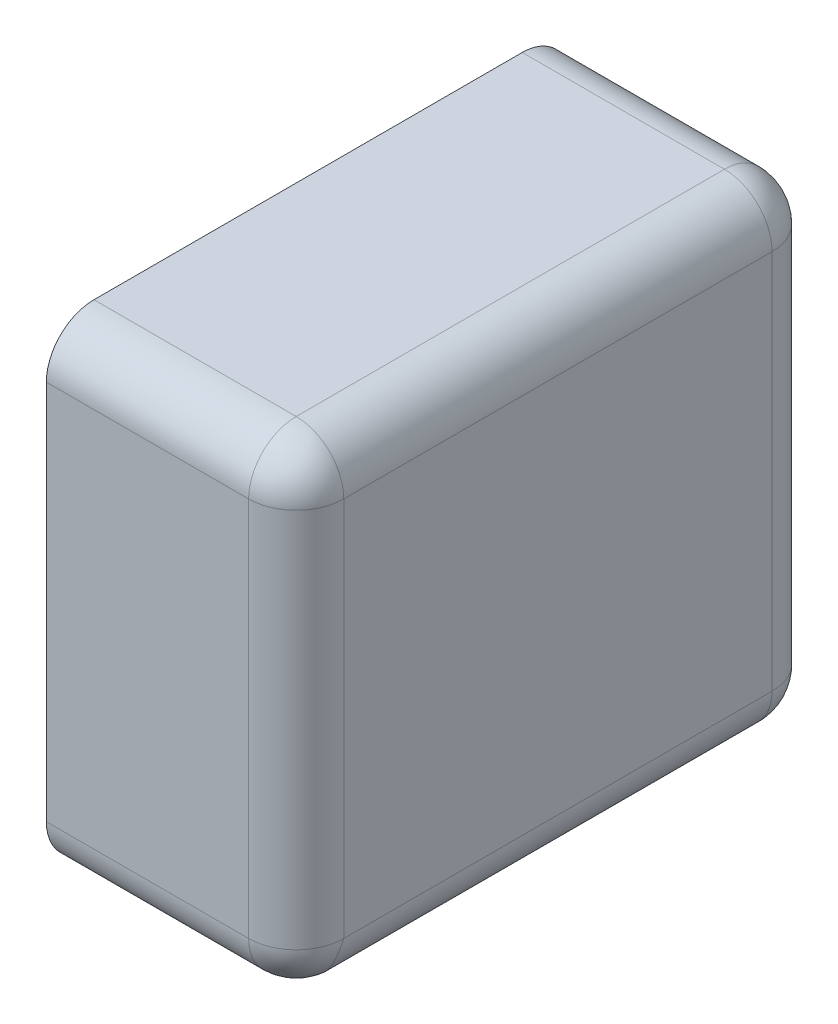
ISO-10303-21;
HEADER;
FILE_DESCRIPTION(('STEP AP214'),'2;1');
FILE_NAME('part.step','',(''),(''),'','','');
FILE_SCHEMA(('AUTOMOTIVE_DESIGN { 1 0 10303 214 1 1 1 1 }'));
ENDSEC;
DATA;
#1=APPLICATION_CONTEXT('core data for automotive mechanical design processes');
#2=APPLICATION_PROTOCOL_DEFINITION('international standard','automotive_design',2000,#1);
#3=PRODUCT_CONTEXT('',#1,'mechanical');
#4=PRODUCT('Part','Part','',(#3));
#5=PRODUCT_RELATED_PRODUCT_CATEGORY('part','',(#4));
#6=PRODUCT_DEFINITION_FORMATION('','',#4);
#7=PRODUCT_DEFINITION_CONTEXT('part definition',#1,'design');
#8=PRODUCT_DEFINITION('design','',#6,#7);
#9=PRODUCT_DEFINITION_SHAPE('','',#8);
#10=(LENGTH_UNIT() NAMED_UNIT(*) SI_UNIT(.MILLI.,.METRE.));
#11=(NAMED_UNIT(*) PLANE_ANGLE_UNIT() SI_UNIT($,.RADIAN.));
#12=(NAMED_UNIT(*) SI_UNIT($,.STERADIAN.) SOLID_ANGLE_UNIT());
#13=UNCERTAINTY_MEASURE_WITH_UNIT(LENGTH_MEASURE(1.E-05),#10,'distance_accuracy_value','');
#14=(GEOMETRIC_REPRESENTATION_CONTEXT(3) GLOBAL_UNCERTAINTY_ASSIGNED_CONTEXT((#13)) GLOBAL_UNIT_ASSIGNED_CONTEXT((#10,
#11,#12)) REPRESENTATION_CONTEXT('',''));
#15=CARTESIAN_POINT('',(0.,0.,0.));
#16=DIRECTION('',(0.,0.,1.));
#17=DIRECTION('',(1.,0.,0.));
#18=AXIS2_PLACEMENT_3D('',#15,#16,#17);
#19=CARTESIAN_POINT('',(0.270000000000001,0.12,0.));
#20=DIRECTION('',(0.,0.,1.));
#21=DIRECTION('',(0.707106781186548,0.707106781186547,0.));
#22=AXIS2_PLACEMENT_3D('',#19,#20,#21);
#23=CYLINDRICAL_SURFACE('',#22,0.03);
#24=CARTESIAN_POINT('',(0.270000000000001,0.12,0.03));
#25=DIRECTION('',(0.,0.,-1.));
#26=DIRECTION('',(0.707106781186548,0.707106781186547,0.));
#27=AXIS2_PLACEMENT_3D('',#24,#25,#26);
#28=CIRCLE('',#27,0.03);
#29=CARTESIAN_POINT('',(0.270000000000001,0.15,0.03));
#30=VERTEX_POINT('',#29);
#31=CARTESIAN_POINT('',(0.3,0.12,0.03));
#32=VERTEX_POINT('',#31);
#33=EDGE_CURVE('E11',#30,#32,#28,.T.);
#34=ORIENTED_EDGE('',*,*,#33,.F.);
#35=DIRECTION('',(0.,0.,1.));
#36=VECTOR('',#35,1.);
#37=CARTESIAN_POINT('',(0.270000000000001,0.15,0.));
#38=LINE('',#37,#36);
#39=CARTESIAN_POINT('',(0.270000000000001,0.15,0.3));
#40=VERTEX_POINT('',#39);
#41=EDGE_CURVE('E24',#30,#40,#38,.T.);
#42=ORIENTED_EDGE('',*,*,#41,.T.);
#43=CARTESIAN_POINT('',(0.270000000000001,0.12,0.3));
#44=DIRECTION('',(0.,0.,1.));
#45=DIRECTION('',(0.707106781186548,0.707106781186547,0.));
#46=AXIS2_PLACEMENT_3D('',#43,#44,#45);
#47=CIRCLE('',#46,0.03);
#48=CARTESIAN_POINT('',(0.3,0.12,0.3));
#49=VERTEX_POINT('',#48);
#50=EDGE_CURVE('E446',#49,#40,#47,.T.);
#51=ORIENTED_EDGE('',*,*,#50,.F.);
#52=DIRECTION('',(0.,0.,-1.));
#53=VECTOR('',#52,1.);
#54=CARTESIAN_POINT('',(0.3,0.12,0.));
#55=LINE('',#54,#53);
#56=EDGE_CURVE('E444',#49,#32,#55,.T.);
#57=ORIENTED_EDGE('',*,*,#56,.T.);
#58=EDGE_LOOP('',(#34,#42,#51,#57));
#59=FACE_BOUND('',#58,.T.);
#60=ADVANCED_FACE('F17',(#59),#23,.T.);
#61=CARTESIAN_POINT('',(0.27,-0.12,0.3));
#62=DIRECTION('',(-0.816496580927727,-0.408248290463863,0.408248290463862));
#63=DIRECTION('',(0.577350269189625,-0.577350269189627,0.577350269189625));
#64=AXIS2_PLACEMENT_3D('',#61,#62,#63);
#65=SPHERICAL_SURFACE('',#64,0.03);
#66=CARTESIAN_POINT('',(0.27,-0.12,0.3));
#67=DIRECTION('',(-1.,0.,0.));
#68=DIRECTION('',(0.,-1.,0.));
#69=AXIS2_PLACEMENT_3D('',#66,#67,#68);
#70=CIRCLE('',#69,0.03);
#71=CARTESIAN_POINT('',(0.27,-0.15,0.3));
#72=VERTEX_POINT('',#71);
#73=CARTESIAN_POINT('',(0.27,-0.12,0.33));
#74=VERTEX_POINT('',#73);
#75=EDGE_CURVE('E443',#72,#74,#70,.T.);
#76=ORIENTED_EDGE('',*,*,#75,.F.);
#77=CARTESIAN_POINT('',(0.27,-0.15,0.3));
#78=CARTESIAN_POINT('',(0.2704988114566,-0.15000001218838,0.300033885984529));
#79=CARTESIAN_POINT('',(0.270997266674897,-0.149987502790529,0.300072700986934));
#80=CARTESIAN_POINT('',(0.271994414549251,-0.149937417339022,0.300159234717374));
#81=CARTESIAN_POINT('',(0.272493098142923,-0.149899728520835,0.300206992800863));
#82=CARTESIAN_POINT('',(0.273489141663646,-0.149799058547557,0.300310340802986));
#83=CARTESIAN_POINT('',(0.273986488076972,-0.149735975701534,0.300365961620001));
#84=CARTESIAN_POINT('',(0.274978329987218,-0.149584423439013,0.300483912490024));
#85=CARTESIAN_POINT('',(0.275472809014332,-0.149495864378045,0.30054626574015));
#86=CARTESIAN_POINT('',(0.276457408349491,-0.149293375435409,0.300676517251717));
#87=CARTESIAN_POINT('',(0.276947510656095,-0.14917936863514,0.300744431920565));
#88=CARTESIAN_POINT('',(0.277921879210046,-0.148926117168614,0.300884606505975));
#89=CARTESIAN_POINT('',(0.278406127362682,-0.148786808810621,0.300956877073712));
#90=CARTESIAN_POINT('',(0.279367344700468,-0.148483203157651,0.301104535317345));
#91=CARTESIAN_POINT('',(0.279844297105908,-0.148318855688421,0.301179929025555));
#92=CARTESIAN_POINT('',(0.280789520120333,-0.14796553704088,0.301332584129445));
#93=CARTESIAN_POINT('',(0.281257776631302,-0.147776529291588,0.301409848157373));
#94=CARTESIAN_POINT('',(0.282184250050681,-0.147374370790128,0.301564980486512));
#95=CARTESIAN_POINT('',(0.282642456850724,-0.147161196950527,0.301642849298233));
#96=CARTESIAN_POINT('',(0.28354752291707,-0.146711301214479,0.301797921149039));
#97=CARTESIAN_POINT('',(0.283994377299662,-0.146474569391927,0.301875123892462));
#98=CARTESIAN_POINT('',(0.284875485043225,-0.145978265027613,0.302027594347783));
#99=CARTESIAN_POINT('',(0.28530973989387,-0.145718695200802,0.302102862288317));
#100=CARTESIAN_POINT('',(0.286164453839678,-0.145177532158359,0.302250202096889));
#101=CARTESIAN_POINT('',(0.286584921848203,-0.144895953586706,0.302322276040923));
#102=CARTESIAN_POINT('',(0.287410930152302,-0.144311697423408,0.302461982438935));
#103=CARTESIAN_POINT('',(0.287816487725631,-0.144009045509088,0.302529620109706));
#104=CARTESIAN_POINT('',(0.288611609698811,-0.143383670573753,0.302659231507785));
#105=CARTESIAN_POINT('',(0.289001200561672,-0.143060983194026,0.302721214834487));
#106=CARTESIAN_POINT('',(0.289763393553022,-0.142396664765597,0.302838325292687));
#107=CARTESIAN_POINT('',(0.290136032021387,-0.142055078090956,0.302893467574624));
#108=CARTESIAN_POINT('',(0.290863397634121,-0.141354183506085,0.302995740989442));
#109=CARTESIAN_POINT('',(0.29121817154898,-0.140994927323628,0.303042893897565));
#110=CARTESIAN_POINT('',(0.291908961165091,-0.140260006134148,0.303128077826375));
#111=CARTESIAN_POINT('',(0.292245034475513,-0.139884398697804,0.303166138205415));
#112=CARTESIAN_POINT('',(0.292897654069066,-0.139118171903413,0.303232077255572));
#113=CARTESIAN_POINT('',(0.293214269055406,-0.138727614334856,0.303259993690955));
#114=CARTESIAN_POINT('',(0.293827283277693,-0.137932962741796,0.303304642403207));
#115=CARTESIAN_POINT('',(0.294123762407378,-0.137528933009151,0.30332142151845));
#116=CARTESIAN_POINT('',(0.294695897931203,-0.136708884767313,0.303342856676105));
#117=CARTESIAN_POINT('',(0.294971645342014,-0.136292931267141,0.303347569126694));
#118=CARTESIAN_POINT('',(0.295501793454286,-0.135450648652353,0.303344001427956));
#119=CARTESIAN_POINT('',(0.295756296059558,-0.135024383436286,0.303335787563462));
#120=CARTESIAN_POINT('',(0.296243514501363,-0.134163148910546,0.303305572586257));
#121=CARTESIAN_POINT('',(0.296476342722002,-0.133728240548299,0.303283647738719));
#122=CARTESIAN_POINT('',(0.29691985675561,-0.132851442274516,0.303225296173099));
#123=CARTESIAN_POINT('',(0.297130664853887,-0.132409608537143,0.303188955588915));
#124=CARTESIAN_POINT('',(0.297529867626478,-0.131520725008768,0.303101142559795));
#125=CARTESIAN_POINT('',(0.297718393736061,-0.131073724852721,0.30304976578243));
#126=CARTESIAN_POINT('',(0.298072845692959,-0.130176310223072,0.302931339667545));
#127=CARTESIAN_POINT('',(0.298238911206526,-0.129725937163117,0.302864394964426));
#128=CARTESIAN_POINT('',(0.298548339496165,-0.128823601756171,0.302714383979636));
#129=CARTESIAN_POINT('',(0.29869184908149,-0.128371671082917,0.302631430511459));
#130=CARTESIAN_POINT('',(0.298956143515048,-0.12746807783126,0.30244905323905));
#131=CARTESIAN_POINT('',(0.299077081092125,-0.127016435722467,0.3023497493774));
#132=CARTESIAN_POINT('',(0.29929629941659,-0.126115236256513,0.302134406235816));
#133=CARTESIAN_POINT('',(0.299394737369101,-0.125665687375364,0.302018492898807));
#134=CARTESIAN_POINT('',(0.299525735241222,-0.1249931673045,0.301831639421765));
#135=CARTESIAN_POINT('',(0.299566536092966,-0.124769899562591,0.301767383329066));
#136=CARTESIAN_POINT('',(0.29964255533454,-0.12432458245702,0.301634658700018));
#137=CARTESIAN_POINT('',(0.299677793860668,-0.124102531645172,0.301566206664674));
#138=CARTESIAN_POINT('',(0.299742716016461,-0.123659887617396,0.301425089688796));
#139=CARTESIAN_POINT('',(0.299772419851868,-0.123439292053119,0.301352441393567));
#140=CARTESIAN_POINT('',(0.299826307791658,-0.122999785093463,0.301202935202406));
#141=CARTESIAN_POINT('',(0.299850512107089,-0.12278087048501,0.301126094051073));
#142=CARTESIAN_POINT('',(0.299893439937734,-0.122344953783418,0.300968212611414));
#143=CARTESIAN_POINT('',(0.299912183618114,-0.122127947599275,0.300887189107669));
#144=CARTESIAN_POINT('',(0.29994423389955,-0.121696073785566,0.300720959873868));
#145=CARTESIAN_POINT('',(0.299957560563846,-0.121481201194103,0.300635770910294));
#146=CARTESIAN_POINT('',(0.299978824512546,-0.121053818670956,0.300461233663095));
#147=CARTESIAN_POINT('',(0.299986781704457,-0.120841302917413,0.300371902070379));
#148=CARTESIAN_POINT('',(0.299997360045311,-0.1204188571993,0.30018911098433));
#149=CARTESIAN_POINT('',(0.300000000885541,-0.120208920565759,0.300095668038792));
#150=CARTESIAN_POINT('',(0.3,-0.12,0.3));
#151=B_SPLINE_CURVE_WITH_KNOTS('',3,(#77,#78,#79,#80,#81,#82,#83,#84,#85,#86,#87,#88,#89,#90,
#91,#92,#93,#94,#95,#96,#97,#98,#99,#100,#101,#102,#103,#104,#105,#106,#107,#108,#109,#110,#111,
#112,#113,#114,#115,#116,#117,#118,#119,#120,#121,#122,#123,#124,#125,#126,#127,#128,#129,#130,
#131,#132,#133,#134,#135,#136,#137,#138,#139,#140,#141,#142,#143,#144,#145,#146,#147,#148,#149,
#150),.UNSPECIFIED.,.F.,.F.,(4,2,2,2,2,2,2,2,2,2,2,2,2,2,2,2,2,2,2,2,2,2,2,2,2,2,2,2,2,2,2,2,2,
2,2,2,4),(0.,0.00149967209897315,0.0030061058174171,0.00451863306598448,0.00603654902173451,
0.00755911671607726,0.00908557168251722,0.0106151266516608,0.0121469762827746,
0.0136803019226446,0.0152142763836234,0.016748068733572,0.0182808490909206,0.0198117934182993,
0.0213400883081261,0.0228649357531864,0.0243855578945877,0.0259012017385216,0.0274111438319798,
0.0289146948859602,0.0304112043327168,0.0319000648012526,0.0333807164925053,0.0348526514325171,
0.0363154175783271,0.0377686227473786,0.039211938336944,0.0406451027955086,0.0420679248033106,
0.0427754956156011,0.0434804430889858,0.0441827642722292,0.0448824610624082,0.0455795402560941,
0.0462740135921419,0.0469658977856005,0.0476552145522495),.UNSPECIFIED.);
#152=CARTESIAN_POINT('',(0.3,-0.12,0.3));
#153=VERTEX_POINT('',#152);
#154=EDGE_CURVE('E210',#72,#153,#151,.T.);
#155=ORIENTED_EDGE('',*,*,#154,.T.);
#156=CARTESIAN_POINT('',(0.27,-0.12,0.3));
#157=DIRECTION('',(0.,1.,0.));
#158=DIRECTION('',(0.,0.,1.));
#159=AXIS2_PLACEMENT_3D('',#156,#157,#158);
#160=CIRCLE('',#159,0.03);
#161=EDGE_CURVE('E240',#74,#153,#160,.T.);
#162=ORIENTED_EDGE('',*,*,#161,.F.);
#163=EDGE_LOOP('',(#76,#155,#162));
#164=FACE_BOUND('',#163,.T.);
#165=ADVANCED_FACE('F215',(#164),#65,.T.);
#166=CARTESIAN_POINT('',(0.270000000000001,0.12,0.3));
#167=DIRECTION('',(0.408248290463862,-0.816496580927727,0.408248290463862));
#168=DIRECTION('',(0.577350269189627,0.577350269189624,0.577350269189627));
#169=AXIS2_PLACEMENT_3D('',#166,#167,#168);
#170=SPHERICAL_SURFACE('',#169,0.03);
#171=CARTESIAN_POINT('',(0.270000000000001,0.12,0.3));
#172=DIRECTION('',(0.,-1.,0.));
#173=DIRECTION('',(1.,0.,0.));
#174=AXIS2_PLACEMENT_3D('',#171,#172,#173);
#175=CIRCLE('',#174,0.03);
#176=CARTESIAN_POINT('',(0.270000000000001,0.12,0.33));
#177=VERTEX_POINT('',#176);
#178=EDGE_CURVE('E232',#49,#177,#175,.T.);
#179=ORIENTED_EDGE('',*,*,#178,.F.);
#180=ORIENTED_EDGE('',*,*,#50,.T.);
#181=CARTESIAN_POINT('',(0.270000000000001,0.12,0.3));
#182=DIRECTION('',(-1.,0.,0.));
#183=DIRECTION('',(0.,0.,1.));
#184=AXIS2_PLACEMENT_3D('',#181,#182,#183);
#185=CIRCLE('',#184,0.03);
#186=EDGE_CURVE('E437',#177,#40,#185,.T.);
#187=ORIENTED_EDGE('',*,*,#186,.F.);
#188=EDGE_LOOP('',(#179,#180,#187));
#189=FACE_BOUND('',#188,.T.);
#190=ADVANCED_FACE('F224',(#189),#170,.T.);
#191=CARTESIAN_POINT('',(0.27,-0.0749999999999999,0.3));
#192=DIRECTION('',(0.,1.,0.));
#193=DIRECTION('',(0.707106781186548,0.,0.707106781186548));
#194=AXIS2_PLACEMENT_3D('',#191,#192,#193);
#195=CYLINDRICAL_SURFACE('',#194,0.03);
#196=ORIENTED_EDGE('',*,*,#161,.T.);
#197=DIRECTION('',(0.,1.,0.));
#198=VECTOR('',#197,1.);
#199=CARTESIAN_POINT('',(0.3,-0.0749999999999999,0.3));
#200=LINE('',#199,#198);
#201=EDGE_CURVE('E433',#153,#49,#200,.T.);
#202=ORIENTED_EDGE('',*,*,#201,.T.);
#203=ORIENTED_EDGE('',*,*,#178,.T.);
#204=DIRECTION('',(0.,-1.,0.));
#205=VECTOR('',#204,1.);
#206=CARTESIAN_POINT('',(0.27,-0.0749999999999999,0.33));
#207=LINE('',#206,#205);
#208=EDGE_CURVE('E429',#177,#74,#207,.T.);
#209=ORIENTED_EDGE('',*,*,#208,.T.);
#210=EDGE_LOOP('',(#196,#202,#203,#209));
#211=FACE_BOUND('',#210,.T.);
#212=ADVANCED_FACE('F244',(#211),#195,.T.);
#213=CARTESIAN_POINT('',(0.3,-0.15,0.));
#214=DIRECTION('',(1.,0.,0.));
#215=DIRECTION('',(0.,1.,0.));
#216=AXIS2_PLACEMENT_3D('',#213,#214,#215);
#217=PLANE('',#216);
#218=DIRECTION('',(0.,-1.,0.));
#219=VECTOR('',#218,1.);
#220=CARTESIAN_POINT('',(0.3,-0.0749999999999999,0.03));
#221=LINE('',#220,#219);
#222=CARTESIAN_POINT('',(0.3,-0.12,0.03));
#223=VERTEX_POINT('',#222);
#224=EDGE_CURVE('E427',#32,#223,#221,.T.);
#225=ORIENTED_EDGE('',*,*,#224,.F.);
#226=ORIENTED_EDGE('',*,*,#56,.F.);
#227=ORIENTED_EDGE('',*,*,#201,.F.);
#228=DIRECTION('',(0.,0.,1.));
#229=VECTOR('',#228,1.);
#230=CARTESIAN_POINT('',(0.3,-0.12,0.));
#231=LINE('',#230,#229);
#232=EDGE_CURVE('E423',#223,#153,#231,.T.);
#233=ORIENTED_EDGE('',*,*,#232,.F.);
#234=EDGE_LOOP('',(#225,#226,#227,#233));
#235=FACE_BOUND('',#234,.T.);
#236=ADVANCED_FACE('F191',(#235),#217,.T.);
#237=CARTESIAN_POINT('',(0.27,-0.12,0.));
#238=DIRECTION('',(0.,0.,1.));
#239=DIRECTION('',(0.707106781186548,-0.707106781186548,0.));
#240=AXIS2_PLACEMENT_3D('',#237,#238,#239);
#241=CYLINDRICAL_SURFACE('',#240,0.03);
#242=CARTESIAN_POINT('',(0.27,-0.12,0.03));
#243=DIRECTION('',(0.,0.,-1.));
#244=DIRECTION('',(0.707106781186548,-0.707106781186548,0.));
#245=AXIS2_PLACEMENT_3D('',#242,#243,#244);
#246=CIRCLE('',#245,0.03);
#247=CARTESIAN_POINT('',(0.27,-0.15,0.03));
#248=VERTEX_POINT('',#247);
#249=EDGE_CURVE('E421',#223,#248,#246,.T.);
#250=ORIENTED_EDGE('',*,*,#249,.F.);
#251=ORIENTED_EDGE('',*,*,#232,.T.);
#252=ORIENTED_EDGE('',*,*,#154,.F.);
#253=DIRECTION('',(0.,0.,-1.));
#254=VECTOR('',#253,1.);
#255=CARTESIAN_POINT('',(0.27,-0.15,0.));
#256=LINE('',#255,#254);
#257=EDGE_CURVE('E419',#72,#248,#256,.T.);
#258=ORIENTED_EDGE('',*,*,#257,.T.);
#259=EDGE_LOOP('',(#250,#251,#252,#258));
#260=FACE_BOUND('',#259,.T.);
#261=ADVANCED_FACE('F186',(#260),#241,.T.);
#262=CARTESIAN_POINT('',(0.270000000000001,0.12,0.03));
#263=DIRECTION('',(0.408248290463862,-0.816496580927727,-0.408248290463863));
#264=DIRECTION('',(0.577350269189626,0.577350269189625,-0.577350269189626));
#265=AXIS2_PLACEMENT_3D('',#262,#263,#264);
#266=SPHERICAL_SURFACE('',#265,0.03);
#267=CARTESIAN_POINT('',(0.270000000000001,0.12,0.03));
#268=DIRECTION('',(-1.,0.,0.));
#269=DIRECTION('',(0.,1.,0.));
#270=AXIS2_PLACEMENT_3D('',#267,#268,#269);
#271=CIRCLE('',#270,0.03);
#272=CARTESIAN_POINT('',(0.270000000000001,0.12,0.));
#273=VERTEX_POINT('',#272);
#274=EDGE_CURVE('E169',#30,#273,#271,.T.);
#275=ORIENTED_EDGE('',*,*,#274,.F.);
#276=ORIENTED_EDGE('',*,*,#33,.T.);
#277=CARTESIAN_POINT('',(0.270000000000001,0.12,0.03));
#278=DIRECTION('',(0.,-1.,0.));
#279=DIRECTION('',(0.,0.,-1.));
#280=AXIS2_PLACEMENT_3D('',#277,#278,#279);
#281=CIRCLE('',#280,0.03);
#282=EDGE_CURVE('E164',#273,#32,#281,.T.);
#283=ORIENTED_EDGE('',*,*,#282,.F.);
#284=EDGE_LOOP('',(#275,#276,#283));
#285=FACE_BOUND('',#284,.T.);
#286=ADVANCED_FACE('F175',(#285),#266,.T.);
#287=CARTESIAN_POINT('',(0.27,-0.12,0.03));
#288=DIRECTION('',(-0.816496580927727,-0.408248290463863,-0.408248290463862));
#289=DIRECTION('',(0.577350269189625,-0.577350269189627,-0.577350269189626));
#290=AXIS2_PLACEMENT_3D('',#287,#288,#289);
#291=SPHERICAL_SURFACE('',#290,0.03);
#292=CARTESIAN_POINT('',(0.27,-0.12,0.03));
#293=DIRECTION('',(0.,1.,0.));
#294=DIRECTION('',(1.,0.,0.));
#295=AXIS2_PLACEMENT_3D('',#292,#293,#294);
#296=CIRCLE('',#295,0.03);
#297=CARTESIAN_POINT('',(0.27,-0.12,0.));
#298=VERTEX_POINT('',#297);
#299=EDGE_CURVE('E162',#223,#298,#296,.T.);
#300=ORIENTED_EDGE('',*,*,#299,.F.);
#301=ORIENTED_EDGE('',*,*,#249,.T.);
#302=CARTESIAN_POINT('',(0.27,-0.12,0.03));
#303=DIRECTION('',(-1.,0.,0.));
#304=DIRECTION('',(0.,0.,-1.));
#305=AXIS2_PLACEMENT_3D('',#302,#303,#304);
#306=CIRCLE('',#305,0.03);
#307=EDGE_CURVE('E108',#298,#248,#306,.T.);
#308=ORIENTED_EDGE('',*,*,#307,.F.);
#309=EDGE_LOOP('',(#300,#301,#308));
#310=FACE_BOUND('',#309,.T.);
#311=ADVANCED_FACE('F185',(#310),#291,.T.);
#312=CARTESIAN_POINT('',(0.27,-0.0749999999999999,0.03));
#313=DIRECTION('',(0.,1.,0.));
#314=DIRECTION('',(0.707106781186547,0.,-0.707106781186548));
#315=AXIS2_PLACEMENT_3D('',#312,#313,#314);
#316=CYLINDRICAL_SURFACE('',#315,0.03);
#317=ORIENTED_EDGE('',*,*,#299,.T.);
#318=DIRECTION('',(0.,1.,0.));
#319=VECTOR('',#318,1.);
#320=CARTESIAN_POINT('',(0.27,-0.0749999999999999,0.));
#321=LINE('',#320,#319);
#322=EDGE_CURVE('E156',#298,#273,#321,.T.);
#323=ORIENTED_EDGE('',*,*,#322,.T.);
#324=ORIENTED_EDGE('',*,*,#282,.T.);
#325=ORIENTED_EDGE('',*,*,#224,.T.);
#326=EDGE_LOOP('',(#317,#323,#324,#325));
#327=FACE_BOUND('',#326,.T.);
#328=ADVANCED_FACE('F311',(#327),#316,.T.);
#329=CARTESIAN_POINT('',(0.15,0.12,0.3));
#330=DIRECTION('',(-1.,0.,0.));
#331=DIRECTION('',(0.,0.707106781186548,0.707106781186547));
#332=AXIS2_PLACEMENT_3D('',#329,#330,#331);
#333=CYLINDRICAL_SURFACE('',#332,0.03);
#334=CARTESIAN_POINT('',(0.1425,0.12,0.3));
#335=DIRECTION('',(1.,0.,0.));
#336=DIRECTION('',(0.,0.707106781186548,0.707106781186547));
#337=AXIS2_PLACEMENT_3D('',#334,#335,#336);
#338=CIRCLE('',#337,0.03);
#339=CARTESIAN_POINT('',(0.1425,0.15,0.3));
#340=VERTEX_POINT('',#339);
#341=CARTESIAN_POINT('',(0.1425,0.12,0.33));
#342=VERTEX_POINT('',#341);
#343=EDGE_CURVE('E154',#340,#342,#338,.T.);
#344=ORIENTED_EDGE('',*,*,#343,.T.);
#345=DIRECTION('',(1.,0.,0.));
#346=VECTOR('',#345,1.);
#347=CARTESIAN_POINT('',(0.15,0.12,0.33));
#348=LINE('',#347,#346);
#349=EDGE_CURVE('E151',#342,#177,#348,.T.);
#350=ORIENTED_EDGE('',*,*,#349,.T.);
#351=ORIENTED_EDGE('',*,*,#186,.T.);
#352=DIRECTION('',(-1.,0.,0.));
#353=VECTOR('',#352,1.);
#354=CARTESIAN_POINT('',(0.15,0.15,0.3));
#355=LINE('',#354,#353);
#356=EDGE_CURVE('E148',#40,#340,#355,.T.);
#357=ORIENTED_EDGE('',*,*,#356,.T.);
#358=EDGE_LOOP('',(#344,#350,#351,#357));
#359=FACE_BOUND('',#358,.T.);
#360=ADVANCED_FACE('F320',(#359),#333,.T.);
#361=CARTESIAN_POINT('',(0.300000000000001,0.15,0.));
#362=DIRECTION('',(0.,1.,0.));
#363=DIRECTION('',(-1.,0.,0.));
#364=AXIS2_PLACEMENT_3D('',#361,#362,#363);
#365=PLANE('',#364);
#366=DIRECTION('',(0.,0.,1.));
#367=VECTOR('',#366,1.);
#368=CARTESIAN_POINT('',(0.1425,0.15,0.165));
#369=LINE('',#368,#367);
#370=CARTESIAN_POINT('',(0.1425,0.15,0.03));
#371=VERTEX_POINT('',#370);
#372=EDGE_CURVE('E145',#371,#340,#369,.T.);
#373=ORIENTED_EDGE('',*,*,#372,.T.);
#374=ORIENTED_EDGE('',*,*,#356,.F.);
#375=ORIENTED_EDGE('',*,*,#41,.F.);
#376=DIRECTION('',(1.,0.,0.));
#377=VECTOR('',#376,1.);
#378=CARTESIAN_POINT('',(0.15,0.15,0.03));
#379=LINE('',#378,#377);
#380=EDGE_CURVE('E140',#371,#30,#379,.T.);
#381=ORIENTED_EDGE('',*,*,#380,.F.);
#382=EDGE_LOOP('',(#373,#374,#375,#381));
#383=FACE_BOUND('',#382,.T.);
#384=ADVANCED_FACE('F329',(#383),#365,.T.);
#385=CARTESIAN_POINT('',(0.,0.,0.33));
#386=DIRECTION('',(0.,0.,1.));
#387=DIRECTION('',(1.,0.,0.));
#388=AXIS2_PLACEMENT_3D('',#385,#386,#387);
#389=PLANE('',#388);
#390=DIRECTION('',(0.,-1.,0.));
#391=VECTOR('',#390,1.);
#392=CARTESIAN_POINT('',(0.1425,-0.165637852898309,0.33));
#393=LINE('',#392,#391);
#394=CARTESIAN_POINT('',(0.1425,-0.12,0.33));
#395=VERTEX_POINT('',#394);
#396=EDGE_CURVE('E138',#342,#395,#393,.T.);
#397=ORIENTED_EDGE('',*,*,#396,.T.);
#398=DIRECTION('',(-1.,0.,0.));
#399=VECTOR('',#398,1.);
#400=CARTESIAN_POINT('',(-0.15,-0.12,0.33));
#401=LINE('',#400,#399);
#402=EDGE_CURVE('E133',#74,#395,#401,.T.);
#403=ORIENTED_EDGE('',*,*,#402,.F.);
#404=ORIENTED_EDGE('',*,*,#208,.F.);
#405=ORIENTED_EDGE('',*,*,#349,.F.);
#406=EDGE_LOOP('',(#397,#403,#404,#405));
#407=FACE_BOUND('',#406,.T.);
#408=ADVANCED_FACE('F339',(#407),#389,.T.);
#409=CARTESIAN_POINT('',(0.15,0.12,0.03));
#410=DIRECTION('',(-1.,0.,0.));
#411=DIRECTION('',(0.,0.707106781186547,-0.707106781186548));
#412=AXIS2_PLACEMENT_3D('',#409,#410,#411);
#413=CYLINDRICAL_SURFACE('',#412,0.03);
#414=CARTESIAN_POINT('',(0.1425,0.12,0.03));
#415=DIRECTION('',(1.,0.,0.));
#416=DIRECTION('',(0.,0.707106781186547,-0.707106781186548));
#417=AXIS2_PLACEMENT_3D('',#414,#415,#416);
#418=CIRCLE('',#417,0.03);
#419=CARTESIAN_POINT('',(0.1425,0.12,0.));
#420=VERTEX_POINT('',#419);
#421=EDGE_CURVE('E130',#420,#371,#418,.T.);
#422=ORIENTED_EDGE('',*,*,#421,.T.);
#423=ORIENTED_EDGE('',*,*,#380,.T.);
#424=ORIENTED_EDGE('',*,*,#274,.T.);
#425=DIRECTION('',(-1.,0.,0.));
#426=VECTOR('',#425,1.);
#427=CARTESIAN_POINT('',(0.15,0.12,0.));
#428=LINE('',#427,#426);
#429=EDGE_CURVE('E125',#273,#420,#428,.T.);
#430=ORIENTED_EDGE('',*,*,#429,.T.);
#431=EDGE_LOOP('',(#422,#423,#424,#430));
#432=FACE_BOUND('',#431,.T.);
#433=ADVANCED_FACE('F349',(#432),#413,.T.);
#434=CARTESIAN_POINT('',(-0.15,-0.12,0.3));
#435=DIRECTION('',(1.,0.,0.));
#436=DIRECTION('',(0.,-0.707106781186548,0.707106781186547));
#437=AXIS2_PLACEMENT_3D('',#434,#435,#436);
#438=CYLINDRICAL_SURFACE('',#437,0.03);
#439=CARTESIAN_POINT('',(0.1425,-0.12,0.3));
#440=DIRECTION('',(1.,0.,0.));
#441=DIRECTION('',(0.,-0.707106781186548,0.707106781186547));
#442=AXIS2_PLACEMENT_3D('',#439,#440,#441);
#443=CIRCLE('',#442,0.03);
#444=CARTESIAN_POINT('',(0.1425,-0.15,0.3));
#445=VERTEX_POINT('',#444);
#446=EDGE_CURVE('E123',#395,#445,#443,.T.);
#447=ORIENTED_EDGE('',*,*,#446,.T.);
#448=DIRECTION('',(1.,0.,0.));
#449=VECTOR('',#448,1.);
#450=CARTESIAN_POINT('',(-0.15,-0.15,0.3));
#451=LINE('',#450,#449);
#452=EDGE_CURVE('E115',#445,#72,#451,.T.);
#453=ORIENTED_EDGE('',*,*,#452,.T.);
#454=ORIENTED_EDGE('',*,*,#75,.T.);
#455=ORIENTED_EDGE('',*,*,#402,.T.);
#456=EDGE_LOOP('',(#447,#453,#454,#455));
#457=FACE_BOUND('',#456,.T.);
#458=ADVANCED_FACE('F359',(#457),#438,.T.);
#459=CARTESIAN_POINT('',(0.,0.,0.));
#460=DIRECTION('',(0.,0.,1.));
#461=DIRECTION('',(1.,0.,0.));
#462=AXIS2_PLACEMENT_3D('',#459,#460,#461);
#463=PLANE('',#462);
#464=DIRECTION('',(0.,1.,0.));
#465=VECTOR('',#464,1.);
#466=CARTESIAN_POINT('',(0.1425,-0.165637852898309,0.));
#467=LINE('',#466,#465);
#468=CARTESIAN_POINT('',(0.1425,-0.12,0.));
#469=VERTEX_POINT('',#468);
#470=EDGE_CURVE('E97',#469,#420,#467,.T.);
#471=ORIENTED_EDGE('',*,*,#470,.T.);
#472=ORIENTED_EDGE('',*,*,#429,.F.);
#473=ORIENTED_EDGE('',*,*,#322,.F.);
#474=DIRECTION('',(1.,0.,0.));
#475=VECTOR('',#474,1.);
#476=CARTESIAN_POINT('',(-0.15,-0.12,0.));
#477=LINE('',#476,#475);
#478=EDGE_CURVE('E101',#469,#298,#477,.T.);
#479=ORIENTED_EDGE('',*,*,#478,.F.);
#480=EDGE_LOOP('',(#471,#472,#473,#479));
#481=FACE_BOUND('',#480,.T.);
#482=ADVANCED_FACE('F369',(#481),#463,.F.);
#483=CARTESIAN_POINT('',(-0.15,-0.12,0.03));
#484=DIRECTION('',(1.,0.,0.));
#485=DIRECTION('',(0.,-0.707106781186547,-0.707106781186548));
#486=AXIS2_PLACEMENT_3D('',#483,#484,#485);
#487=CYLINDRICAL_SURFACE('',#486,0.03);
#488=CARTESIAN_POINT('',(0.1425,-0.12,0.03));
#489=DIRECTION('',(1.,0.,0.));
#490=DIRECTION('',(0.,-0.707106781186547,-0.707106781186548));
#491=AXIS2_PLACEMENT_3D('',#488,#489,#490);
#492=CIRCLE('',#491,0.03);
#493=CARTESIAN_POINT('',(0.1425,-0.15,0.03));
#494=VERTEX_POINT('',#493);
#495=EDGE_CURVE('E90',#494,#469,#492,.T.);
#496=ORIENTED_EDGE('',*,*,#495,.T.);
#497=ORIENTED_EDGE('',*,*,#478,.T.);
#498=ORIENTED_EDGE('',*,*,#307,.T.);
#499=DIRECTION('',(-1.,0.,0.));
#500=VECTOR('',#499,1.);
#501=CARTESIAN_POINT('',(-0.15,-0.15,0.03));
#502=LINE('',#501,#500);
#503=EDGE_CURVE('E102',#248,#494,#502,.T.);
#504=ORIENTED_EDGE('',*,*,#503,.T.);
#505=EDGE_LOOP('',(#496,#497,#498,#504));
#506=FACE_BOUND('',#505,.T.);
#507=ADVANCED_FACE('F106',(#506),#487,.T.);
#508=CARTESIAN_POINT('',(-0.3,-0.15,0.));
#509=DIRECTION('',(0.,-1.,0.));
#510=DIRECTION('',(1.,0.,0.));
#511=AXIS2_PLACEMENT_3D('',#508,#509,#510);
#512=PLANE('',#511);
#513=DIRECTION('',(0.,0.,-1.));
#514=VECTOR('',#513,1.);
#515=CARTESIAN_POINT('',(0.1425,-0.15,0.165));
#516=LINE('',#515,#514);
#517=EDGE_CURVE('E95',#445,#494,#516,.T.);
#518=ORIENTED_EDGE('',*,*,#517,.T.);
#519=ORIENTED_EDGE('',*,*,#503,.F.);
#520=ORIENTED_EDGE('',*,*,#257,.F.);
#521=ORIENTED_EDGE('',*,*,#452,.F.);
#522=EDGE_LOOP('',(#518,#519,#520,#521));
#523=FACE_BOUND('',#522,.T.);
#524=ADVANCED_FACE('F113',(#523),#512,.T.);
#525=CARTESIAN_POINT('',(0.1425,-0.331275705796617,0.33));
#526=DIRECTION('',(1.,0.,0.));
#527=DIRECTION('',(0.,1.,0.));
#528=AXIS2_PLACEMENT_3D('',#525,#526,#527);
#529=PLANE('',#528);
#530=ORIENTED_EDGE('',*,*,#343,.F.);
#531=ORIENTED_EDGE('',*,*,#372,.F.);
#532=ORIENTED_EDGE('',*,*,#421,.F.);
#533=ORIENTED_EDGE('',*,*,#470,.F.);
#534=ORIENTED_EDGE('',*,*,#495,.F.);
#535=ORIENTED_EDGE('',*,*,#517,.F.);
#536=ORIENTED_EDGE('',*,*,#446,.F.);
#537=ORIENTED_EDGE('',*,*,#396,.F.);
#538=EDGE_LOOP('',(#530,#531,#532,#533,#534,#535,#536,#537));
#539=FACE_BOUND('',#538,.T.);
#540=ADVANCED_FACE('F92',(#539),#529,.F.);
#541=CLOSED_SHELL('',(#60,#165,#190,#212,#236,#261,#286,#311,#328,#360,#384,#408,#433,#458,#482,
#507,#524,#540));
#542=MANIFOLD_SOLID_BREP('B1',#541);
#543=ADVANCED_BREP_SHAPE_REPRESENTATION('',(#18,#542),#14);
#544=SHAPE_DEFINITION_REPRESENTATION(#9,#543);
ENDSEC;
END-ISO-10303-21;
